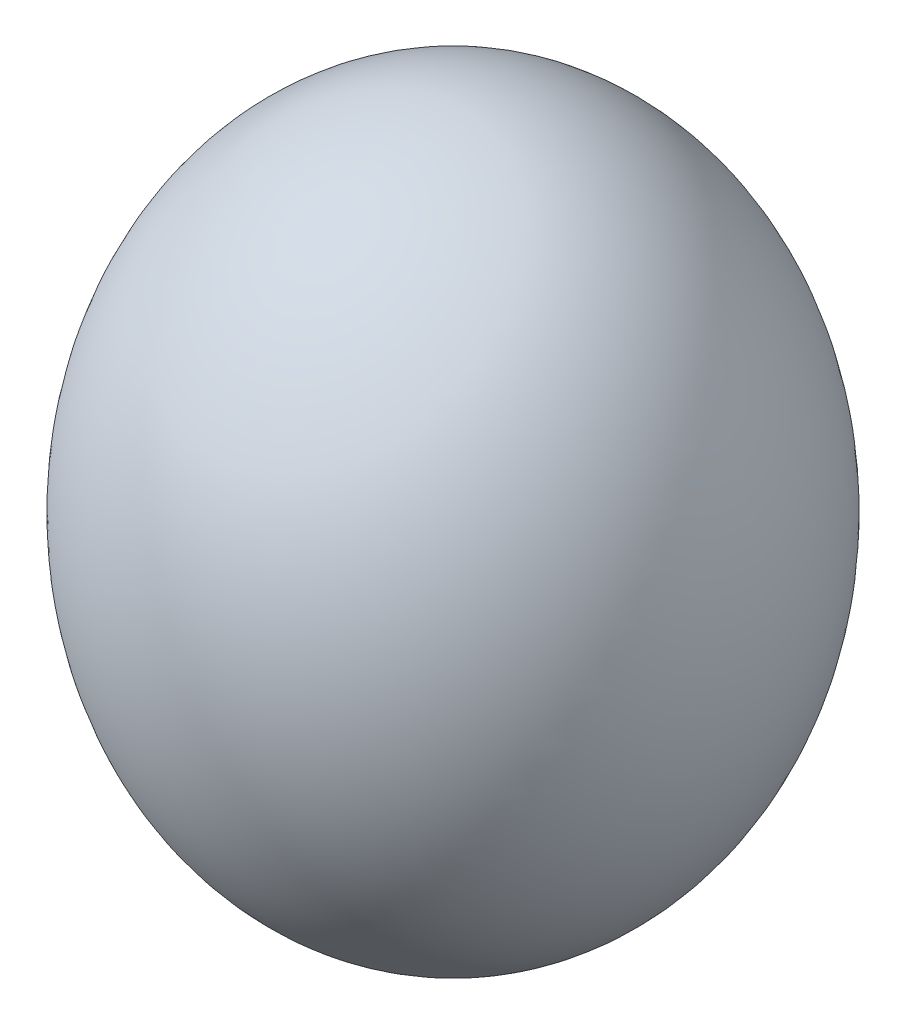
ISO-10303-21;
HEADER;
FILE_DESCRIPTION(('STEP AP214'),'2;1');
FILE_NAME('part.step','',(''),(''),'','','');
FILE_SCHEMA(('AUTOMOTIVE_DESIGN { 1 0 10303 214 1 1 1 1 }'));
ENDSEC;
DATA;
#1=APPLICATION_CONTEXT('core data for automotive mechanical design processes');
#2=APPLICATION_PROTOCOL_DEFINITION('international standard','automotive_design',2000,#1);
#3=PRODUCT_CONTEXT('',#1,'mechanical');
#4=PRODUCT('Part','Part','',(#3));
#5=PRODUCT_RELATED_PRODUCT_CATEGORY('part','',(#4));
#6=PRODUCT_DEFINITION_FORMATION('','',#4);
#7=PRODUCT_DEFINITION_CONTEXT('part definition',#1,'design');
#8=PRODUCT_DEFINITION('design','',#6,#7);
#9=PRODUCT_DEFINITION_SHAPE('','',#8);
#10=(LENGTH_UNIT() NAMED_UNIT(*) SI_UNIT(.MILLI.,.METRE.));
#11=(NAMED_UNIT(*) PLANE_ANGLE_UNIT() SI_UNIT($,.RADIAN.));
#12=(NAMED_UNIT(*) SI_UNIT($,.STERADIAN.) SOLID_ANGLE_UNIT());
#13=UNCERTAINTY_MEASURE_WITH_UNIT(LENGTH_MEASURE(1.E-05),#10,'distance_accuracy_value','');
#14=(GEOMETRIC_REPRESENTATION_CONTEXT(3) GLOBAL_UNCERTAINTY_ASSIGNED_CONTEXT((#13)) GLOBAL_UNIT_ASSIGNED_CONTEXT((#10,
#11,#12)) REPRESENTATION_CONTEXT('',''));
#15=CARTESIAN_POINT('',(0.,0.,0.));
#16=DIRECTION('',(0.,0.,1.));
#17=DIRECTION('',(1.,0.,0.));
#18=AXIS2_PLACEMENT_3D('',#15,#16,#17);
#19=CARTESIAN_POINT('',(0.,32.8,0.));
#20=DIRECTION('',(0.,0.,1.));
#21=DIRECTION('',(0.,1.,0.));
#22=AXIS2_PLACEMENT_3D('',#19,#20,#21);
#23=ELLIPSE('',#22,32.8,27.);
#24=TRIMMED_CURVE('',#23,(PARAMETER_VALUE(3.14159265358979)),
(PARAMETER_VALUE(6.28318530717959)),.T.,.PARAMETER.);
#25=CARTESIAN_POINT('',(0.,0.,0.));
#26=DIRECTION('',(0.,-1.,0.));
#27=AXIS1_PLACEMENT('',#25,#26);
#28=SURFACE_OF_REVOLUTION('',#24,#27);
#29=CARTESIAN_POINT('',(0.,65.6,0.));
#30=VERTEX_POINT('',#29);
#31=VERTEX_LOOP('',#30);
#32=FACE_BOUND('',#31,.T.);
#33=CARTESIAN_POINT('',(0.,0.,0.));
#34=VERTEX_POINT('',#33);
#35=VERTEX_LOOP('',#34);
#36=FACE_BOUND('',#35,.T.);
#37=ADVANCED_FACE('F38',(#32,#36),#28,.F.);
#38=CLOSED_SHELL('',(#37));
#39=MANIFOLD_SOLID_BREP('B2',#38);
#40=ADVANCED_BREP_SHAPE_REPRESENTATION('',(#18,#39),#14);
#41=SHAPE_DEFINITION_REPRESENTATION(#9,#40);
ENDSEC;
END-ISO-10303-21;
